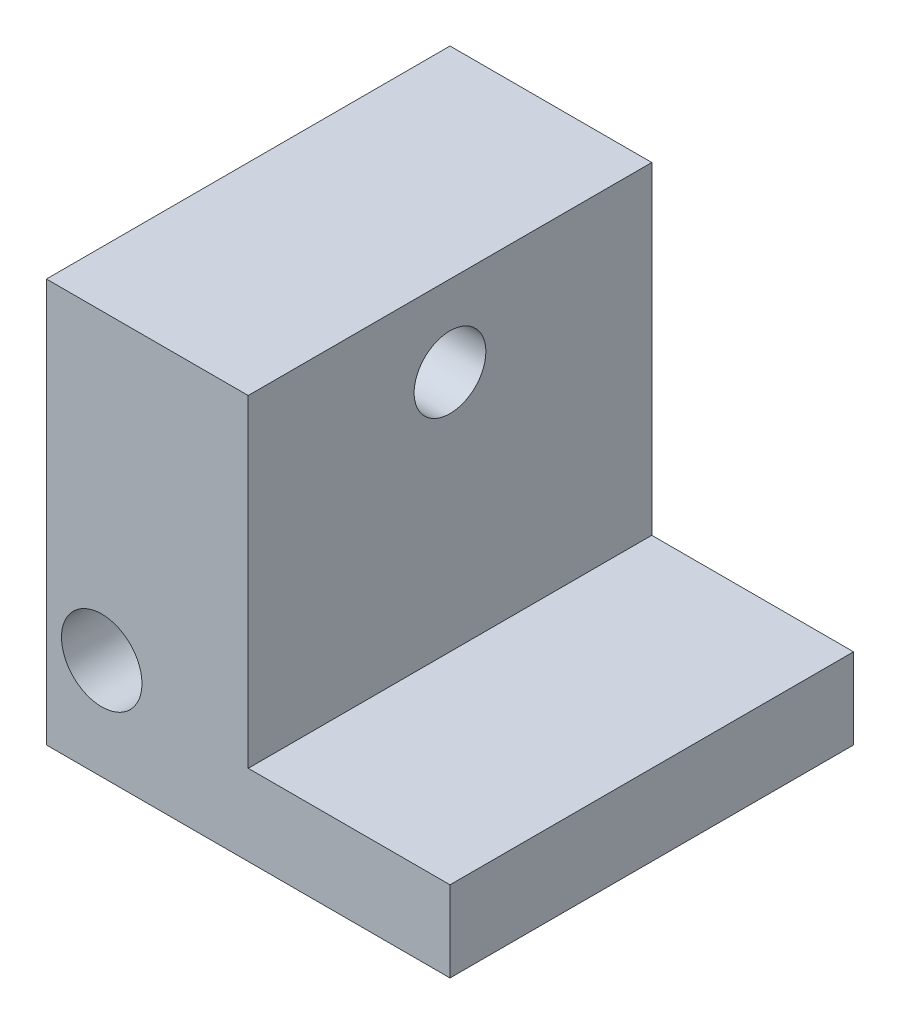
ISO-10303-21;
HEADER;
FILE_DESCRIPTION(('STEP AP214'),'2;1');
FILE_NAME('part.step','',(''),(''),'','','');
FILE_SCHEMA(('AUTOMOTIVE_DESIGN { 1 0 10303 214 1 1 1 1 }'));
ENDSEC;
DATA;
#1=APPLICATION_CONTEXT('core data for automotive mechanical design processes');
#2=APPLICATION_PROTOCOL_DEFINITION('international standard','automotive_design',2000,#1);
#3=PRODUCT_CONTEXT('',#1,'mechanical');
#4=PRODUCT('Part','Part','',(#3));
#5=PRODUCT_RELATED_PRODUCT_CATEGORY('part','',(#4));
#6=PRODUCT_DEFINITION_FORMATION('','',#4);
#7=PRODUCT_DEFINITION_CONTEXT('part definition',#1,'design');
#8=PRODUCT_DEFINITION('design','',#6,#7);
#9=PRODUCT_DEFINITION_SHAPE('','',#8);
#10=(LENGTH_UNIT() NAMED_UNIT(*) SI_UNIT(.MILLI.,.METRE.));
#11=(NAMED_UNIT(*) PLANE_ANGLE_UNIT() SI_UNIT($,.RADIAN.));
#12=(NAMED_UNIT(*) SI_UNIT($,.STERADIAN.) SOLID_ANGLE_UNIT());
#13=UNCERTAINTY_MEASURE_WITH_UNIT(LENGTH_MEASURE(1.E-05),#10,'distance_accuracy_value','');
#14=(GEOMETRIC_REPRESENTATION_CONTEXT(3) GLOBAL_UNCERTAINTY_ASSIGNED_CONTEXT((#13)) GLOBAL_UNIT_ASSIGNED_CONTEXT((#10,
#11,#12)) REPRESENTATION_CONTEXT('',''));
#15=CARTESIAN_POINT('',(0.,0.,0.));
#16=DIRECTION('',(0.,0.,1.));
#17=DIRECTION('',(1.,0.,0.));
#18=AXIS2_PLACEMENT_3D('',#15,#16,#17);
#19=CARTESIAN_POINT('',(0.,0.,10.));
#20=DIRECTION('',(1.,0.,0.));
#21=DIRECTION('',(0.,0.,-1.));
#22=AXIS2_PLACEMENT_3D('',#19,#20,#21);
#23=PLANE('',#22);
#24=CARTESIAN_POINT('',(0.,8.,5.));
#25=DIRECTION('',(1.,0.,0.));
#26=DIRECTION('',(0.,0.,-1.));
#27=AXIS2_PLACEMENT_3D('',#24,#25,#26);
#28=CIRCLE('',#27,0.888999999999999);
#29=CARTESIAN_POINT('',(0.,8.,4.111));
#30=VERTEX_POINT('',#29);
#31=EDGE_CURVE('E43',#30,#30,#28,.T.);
#32=ORIENTED_EDGE('',*,*,#31,.T.);
#33=EDGE_LOOP('',(#32));
#34=FACE_BOUND('',#33,.T.);
#35=CARTESIAN_POINT('',(0.,2.5,5.));
#36=DIRECTION('',(-1.,0.,0.));
#37=DIRECTION('',(0.,0.,1.));
#38=AXIS2_PLACEMENT_3D('',#35,#36,#37);
#39=CIRCLE('',#38,1.25);
#40=CARTESIAN_POINT('',(0.,2.5,6.25));
#41=VERTEX_POINT('',#40);
#42=EDGE_CURVE('E135',#41,#41,#39,.T.);
#43=ORIENTED_EDGE('',*,*,#42,.F.);
#44=EDGE_LOOP('',(#43));
#45=FACE_BOUND('',#44,.T.);
#46=DIRECTION('',(0.,-1.,0.));
#47=VECTOR('',#46,1.);
#48=CARTESIAN_POINT('',(0.,0.,0.));
#49=LINE('',#48,#47);
#50=CARTESIAN_POINT('',(0.,10.,0.));
#51=VERTEX_POINT('',#50);
#52=CARTESIAN_POINT('',(0.,0.,0.));
#53=VERTEX_POINT('',#52);
#54=EDGE_CURVE('E116',#51,#53,#49,.T.);
#55=ORIENTED_EDGE('',*,*,#54,.T.);
#56=DIRECTION('',(0.,0.,-1.));
#57=VECTOR('',#56,1.);
#58=CARTESIAN_POINT('',(0.,0.,10.));
#59=LINE('',#58,#57);
#60=CARTESIAN_POINT('',(0.,0.,10.));
#61=VERTEX_POINT('',#60);
#62=EDGE_CURVE('E11',#61,#53,#59,.T.);
#63=ORIENTED_EDGE('',*,*,#62,.F.);
#64=DIRECTION('',(0.,-1.,0.));
#65=VECTOR('',#64,1.);
#66=CARTESIAN_POINT('',(0.,0.,10.));
#67=LINE('',#66,#65);
#68=CARTESIAN_POINT('',(0.,10.,10.));
#69=VERTEX_POINT('',#68);
#70=EDGE_CURVE('E117',#69,#61,#67,.T.);
#71=ORIENTED_EDGE('',*,*,#70,.F.);
#72=DIRECTION('',(0.,0.,-1.));
#73=VECTOR('',#72,1.);
#74=CARTESIAN_POINT('',(0.,10.,10.));
#75=LINE('',#74,#73);
#76=EDGE_CURVE('E126',#69,#51,#75,.T.);
#77=ORIENTED_EDGE('',*,*,#76,.T.);
#78=EDGE_LOOP('',(#55,#63,#71,#77));
#79=FACE_BOUND('',#78,.T.);
#80=ADVANCED_FACE('F40',(#34,#45,#79),#23,.F.);
#81=CARTESIAN_POINT('',(0.,0.,10.));
#82=DIRECTION('',(0.,1.,0.));
#83=DIRECTION('',(0.,0.,1.));
#84=AXIS2_PLACEMENT_3D('',#81,#82,#83);
#85=PLANE('',#84);
#86=DIRECTION('',(1.,0.,0.));
#87=VECTOR('',#86,1.);
#88=CARTESIAN_POINT('',(0.,0.,0.));
#89=LINE('',#88,#87);
#90=CARTESIAN_POINT('',(10.,0.,0.));
#91=VERTEX_POINT('',#90);
#92=EDGE_CURVE('E122',#53,#91,#89,.T.);
#93=ORIENTED_EDGE('',*,*,#92,.T.);
#94=DIRECTION('',(0.,0.,-1.));
#95=VECTOR('',#94,1.);
#96=CARTESIAN_POINT('',(10.,0.,10.));
#97=LINE('',#96,#95);
#98=CARTESIAN_POINT('',(10.,0.,10.));
#99=VERTEX_POINT('',#98);
#100=EDGE_CURVE('E48',#99,#91,#97,.T.);
#101=ORIENTED_EDGE('',*,*,#100,.F.);
#102=DIRECTION('',(1.,0.,0.));
#103=VECTOR('',#102,1.);
#104=CARTESIAN_POINT('',(0.,0.,10.));
#105=LINE('',#104,#103);
#106=EDGE_CURVE('E88',#61,#99,#105,.T.);
#107=ORIENTED_EDGE('',*,*,#106,.F.);
#108=ORIENTED_EDGE('',*,*,#62,.T.);
#109=EDGE_LOOP('',(#93,#101,#107,#108));
#110=FACE_BOUND('',#109,.T.);
#111=ADVANCED_FACE('F156',(#110),#85,.F.);
#112=CARTESIAN_POINT('',(10.,0.,10.));
#113=DIRECTION('',(-1.,0.,0.));
#114=DIRECTION('',(0.,0.,1.));
#115=AXIS2_PLACEMENT_3D('',#112,#113,#114);
#116=PLANE('',#115);
#117=DIRECTION('',(0.,1.,0.));
#118=VECTOR('',#117,1.);
#119=CARTESIAN_POINT('',(10.,0.,0.));
#120=LINE('',#119,#118);
#121=CARTESIAN_POINT('',(10.,2.,0.));
#122=VERTEX_POINT('',#121);
#123=EDGE_CURVE('E118',#91,#122,#120,.T.);
#124=ORIENTED_EDGE('',*,*,#123,.T.);
#125=DIRECTION('',(0.,0.,1.));
#126=VECTOR('',#125,1.);
#127=CARTESIAN_POINT('',(10.,2.,0.));
#128=LINE('',#127,#126);
#129=CARTESIAN_POINT('',(10.,2.,10.));
#130=VERTEX_POINT('',#129);
#131=EDGE_CURVE('E170',#122,#130,#128,.T.);
#132=ORIENTED_EDGE('',*,*,#131,.T.);
#133=DIRECTION('',(0.,1.,0.));
#134=VECTOR('',#133,1.);
#135=CARTESIAN_POINT('',(10.,0.,10.));
#136=LINE('',#135,#134);
#137=EDGE_CURVE('E176',#99,#130,#136,.T.);
#138=ORIENTED_EDGE('',*,*,#137,.F.);
#139=ORIENTED_EDGE('',*,*,#100,.T.);
#140=EDGE_LOOP('',(#124,#132,#138,#139));
#141=FACE_BOUND('',#140,.T.);
#142=ADVANCED_FACE('F161',(#141),#116,.F.);
#143=CARTESIAN_POINT('',(0.,10.,10.));
#144=DIRECTION('',(0.,-1.,0.));
#145=DIRECTION('',(0.,0.,-1.));
#146=AXIS2_PLACEMENT_3D('',#143,#144,#145);
#147=PLANE('',#146);
#148=DIRECTION('',(-1.,0.,0.));
#149=VECTOR('',#148,1.);
#150=CARTESIAN_POINT('',(0.,10.,10.));
#151=LINE('',#150,#149);
#152=CARTESIAN_POINT('',(5.,10.,10.));
#153=VERTEX_POINT('',#152);
#154=EDGE_CURVE('E65',#153,#69,#151,.T.);
#155=ORIENTED_EDGE('',*,*,#154,.F.);
#156=DIRECTION('',(0.,0.,1.));
#157=VECTOR('',#156,1.);
#158=CARTESIAN_POINT('',(5.,10.,0.));
#159=LINE('',#158,#157);
#160=CARTESIAN_POINT('',(5.,10.,0.));
#161=VERTEX_POINT('',#160);
#162=EDGE_CURVE('E106',#161,#153,#159,.T.);
#163=ORIENTED_EDGE('',*,*,#162,.F.);
#164=DIRECTION('',(-1.,0.,0.));
#165=VECTOR('',#164,1.);
#166=CARTESIAN_POINT('',(0.,10.,0.));
#167=LINE('',#166,#165);
#168=EDGE_CURVE('E83',#161,#51,#167,.T.);
#169=ORIENTED_EDGE('',*,*,#168,.T.);
#170=ORIENTED_EDGE('',*,*,#76,.F.);
#171=EDGE_LOOP('',(#155,#163,#169,#170));
#172=FACE_BOUND('',#171,.T.);
#173=ADVANCED_FACE('F111',(#172),#147,.F.);
#174=CARTESIAN_POINT('',(0.,10.,10.));
#175=DIRECTION('',(0.,0.,-1.));
#176=DIRECTION('',(-1.,0.,0.));
#177=AXIS2_PLACEMENT_3D('',#174,#175,#176);
#178=PLANE('',#177);
#179=CARTESIAN_POINT('',(1.37,2.5,10.));
#180=DIRECTION('',(0.,0.,1.));
#181=DIRECTION('',(1.,0.,0.));
#182=AXIS2_PLACEMENT_3D('',#179,#180,#181);
#183=CIRCLE('',#182,0.996949999999999);
#184=CARTESIAN_POINT('',(2.36695,2.5,10.));
#185=VERTEX_POINT('',#184);
#186=EDGE_CURVE('E136',#185,#185,#183,.T.);
#187=ORIENTED_EDGE('',*,*,#186,.F.);
#188=EDGE_LOOP('',(#187));
#189=FACE_BOUND('',#188,.T.);
#190=ORIENTED_EDGE('',*,*,#137,.T.);
#191=DIRECTION('',(1.,0.,0.));
#192=VECTOR('',#191,1.);
#193=CARTESIAN_POINT('',(10.,2.,10.));
#194=LINE('',#193,#192);
#195=CARTESIAN_POINT('',(5.,2.,10.));
#196=VERTEX_POINT('',#195);
#197=EDGE_CURVE('E109',#196,#130,#194,.T.);
#198=ORIENTED_EDGE('',*,*,#197,.F.);
#199=DIRECTION('',(0.,-1.,0.));
#200=VECTOR('',#199,1.);
#201=CARTESIAN_POINT('',(5.,10.,10.));
#202=LINE('',#201,#200);
#203=EDGE_CURVE('E182',#153,#196,#202,.T.);
#204=ORIENTED_EDGE('',*,*,#203,.F.);
#205=ORIENTED_EDGE('',*,*,#154,.T.);
#206=ORIENTED_EDGE('',*,*,#70,.T.);
#207=ORIENTED_EDGE('',*,*,#106,.T.);
#208=EDGE_LOOP('',(#190,#198,#204,#205,#206,#207));
#209=FACE_BOUND('',#208,.T.);
#210=ADVANCED_FACE('F203',(#189,#209),#178,.F.);
#211=CARTESIAN_POINT('',(0.,10.,0.));
#212=DIRECTION('',(0.,0.,-1.));
#213=DIRECTION('',(-1.,0.,0.));
#214=AXIS2_PLACEMENT_3D('',#211,#212,#213);
#215=PLANE('',#214);
#216=DIRECTION('',(1.,0.,0.));
#217=VECTOR('',#216,1.);
#218=CARTESIAN_POINT('',(10.,2.,0.));
#219=LINE('',#218,#217);
#220=CARTESIAN_POINT('',(5.,2.,0.));
#221=VERTEX_POINT('',#220);
#222=EDGE_CURVE('E56',#221,#122,#219,.T.);
#223=ORIENTED_EDGE('',*,*,#222,.T.);
#224=ORIENTED_EDGE('',*,*,#123,.F.);
#225=ORIENTED_EDGE('',*,*,#92,.F.);
#226=ORIENTED_EDGE('',*,*,#54,.F.);
#227=ORIENTED_EDGE('',*,*,#168,.F.);
#228=DIRECTION('',(0.,-1.,0.));
#229=VECTOR('',#228,1.);
#230=CARTESIAN_POINT('',(5.,10.,0.));
#231=LINE('',#230,#229);
#232=EDGE_CURVE('E103',#161,#221,#231,.T.);
#233=ORIENTED_EDGE('',*,*,#232,.T.);
#234=EDGE_LOOP('',(#223,#224,#225,#226,#227,#233));
#235=FACE_BOUND('',#234,.T.);
#236=ADVANCED_FACE('F114',(#235),#215,.T.);
#237=CARTESIAN_POINT('',(10.,2.,0.));
#238=DIRECTION('',(0.,-1.,0.));
#239=DIRECTION('',(0.,0.,-1.));
#240=AXIS2_PLACEMENT_3D('',#237,#238,#239);
#241=PLANE('',#240);
#242=ORIENTED_EDGE('',*,*,#197,.T.);
#243=ORIENTED_EDGE('',*,*,#131,.F.);
#244=ORIENTED_EDGE('',*,*,#222,.F.);
#245=DIRECTION('',(0.,0.,1.));
#246=VECTOR('',#245,1.);
#247=CARTESIAN_POINT('',(5.,2.,0.));
#248=LINE('',#247,#246);
#249=EDGE_CURVE('E107',#221,#196,#248,.T.);
#250=ORIENTED_EDGE('',*,*,#249,.T.);
#251=EDGE_LOOP('',(#242,#243,#244,#250));
#252=FACE_BOUND('',#251,.T.);
#253=ADVANCED_FACE('F197',(#252),#241,.F.);
#254=CARTESIAN_POINT('',(5.,10.,0.));
#255=DIRECTION('',(-1.,0.,0.));
#256=DIRECTION('',(0.,-1.,0.));
#257=AXIS2_PLACEMENT_3D('',#254,#255,#256);
#258=PLANE('',#257);
#259=CARTESIAN_POINT('',(5.,8.,5.));
#260=DIRECTION('',(1.,0.,0.));
#261=DIRECTION('',(0.,0.,-1.));
#262=AXIS2_PLACEMENT_3D('',#259,#260,#261);
#263=CIRCLE('',#262,0.888999999999999);
#264=CARTESIAN_POINT('',(5.,8.,4.111));
#265=VERTEX_POINT('',#264);
#266=EDGE_CURVE('E190',#265,#265,#263,.T.);
#267=ORIENTED_EDGE('',*,*,#266,.F.);
#268=EDGE_LOOP('',(#267));
#269=FACE_BOUND('',#268,.T.);
#270=ORIENTED_EDGE('',*,*,#203,.T.);
#271=ORIENTED_EDGE('',*,*,#249,.F.);
#272=ORIENTED_EDGE('',*,*,#232,.F.);
#273=ORIENTED_EDGE('',*,*,#162,.T.);
#274=EDGE_LOOP('',(#270,#271,#272,#273));
#275=FACE_BOUND('',#274,.T.);
#276=ADVANCED_FACE('F105',(#269,#275),#258,.F.);
#277=CARTESIAN_POINT('',(4.5,2.5,5.));
#278=DIRECTION('',(-1.,0.,0.));
#279=DIRECTION('',(0.,0.,1.));
#280=AXIS2_PLACEMENT_3D('',#277,#278,#279);
#281=CYLINDRICAL_SURFACE('',#280,1.25);
#282=CARTESIAN_POINT('',(2.36695,2.5,6.25));
#283=CARTESIAN_POINT('',(2.36694594630764,2.54791313103867,6.2499960646669));
#284=CARTESIAN_POINT('',(2.36346836075757,2.59587972387663,6.24721773356943));
#285=CARTESIAN_POINT('',(2.34979324779088,2.69025986717115,6.23635311687289));
#286=CARTESIAN_POINT('',(2.33958394402582,2.73667054595228,6.22825752945655));
#287=CARTESIAN_POINT('',(2.31318001371666,2.82633151815205,6.20752340205111));
#288=CARTESIAN_POINT('',(2.297022423587,2.8695994249651,6.19491298627052));
#289=CARTESIAN_POINT('',(2.25952117219664,2.95247513095169,6.16605999656845));
#290=CARTESIAN_POINT('',(2.23817689470435,2.99208249444279,6.14981699107641));
#291=CARTESIAN_POINT('',(2.18286914021065,3.08027875560777,6.1085555323129));
#292=CARTESIAN_POINT('',(2.14709594981161,3.12722273012476,6.08244678337511));
#293=CARTESIAN_POINT('',(2.06876776926455,3.2134724476195,6.02765664579406));
#294=CARTESIAN_POINT('',(2.02619344852624,3.2527556879721,5.99896802924648));
#295=CARTESIAN_POINT('',(1.93426984107149,3.32398385864142,5.94110741756957));
#296=CARTESIAN_POINT('',(1.88482563389917,3.35580539246783,5.91193483272516));
#297=CARTESIAN_POINT('',(1.77967606508001,3.41081112042258,5.85698183920585));
#298=CARTESIAN_POINT('',(1.72399261398733,3.43402437880897,5.83119020965493));
#299=CARTESIAN_POINT('',(1.63118892262307,3.46278195224579,5.79738467919047));
#300=CARTESIAN_POINT('',(1.59617328135613,3.47164715591319,5.78646474342493));
#301=CARTESIAN_POINT('',(1.52438817329319,3.48559841187969,5.76890974280709));
#302=CARTESIAN_POINT('',(1.48762323642806,3.49069371426182,5.76226419530484));
#303=CARTESIAN_POINT('',(1.41282619487753,3.49674011402863,5.75434611906331));
#304=CARTESIAN_POINT('',(1.37478597597296,3.49765562043814,5.75311973736022));
#305=CARTESIAN_POINT('',(1.29908987207632,3.49514763426627,5.7564282694666));
#306=CARTESIAN_POINT('',(1.26143435628528,3.49172030795598,5.76096827368558));
#307=CARTESIAN_POINT('',(1.18175340228749,3.47997353079027,5.77604970509553));
#308=CARTESIAN_POINT('',(1.13999923589683,3.47095589358572,5.78743895382164));
#309=CARTESIAN_POINT('',(1.05928896434878,3.44822831094768,5.81466340878495));
#310=CARTESIAN_POINT('',(1.02034149347528,3.43450457633048,5.83051165540955));
#311=CARTESIAN_POINT('',(0.927241632400093,3.39527782092615,5.8730192094996));
#312=CARTESIAN_POINT('',(0.874841508493267,3.36728767765739,5.90120098422096));
#313=CARTESIAN_POINT('',(0.776242985823805,3.30301176619865,5.95893336767244));
#314=CARTESIAN_POINT('',(0.730053620305662,3.26671411797453,5.98848588789053));
#315=CARTESIAN_POINT('',(0.643135292758055,3.18499754065215,6.04683595170898));
#316=CARTESIAN_POINT('',(0.602573703772724,3.13937139517527,6.07559557636781));
#317=CARTESIAN_POINT('',(0.529629181817666,3.03987656640665,6.12880328187914));
#318=CARTESIAN_POINT('',(0.497224151951312,2.98603080156488,6.15326295621664));
#319=CARTESIAN_POINT('',(0.450380262457955,2.88763545742939,6.18917522968529));
#320=CARTESIAN_POINT('',(0.433455570721597,2.84489338855595,6.2023441395035));
#321=CARTESIAN_POINT('',(0.405482940532336,2.7564404904196,6.22425792414338));
#322=CARTESIAN_POINT('',(0.394430556923111,2.71073193619151,6.23300614504425));
#323=CARTESIAN_POINT('',(0.378834650698276,2.61727950874941,6.24538214813328));
#324=CARTESIAN_POINT('',(0.374324166681739,2.56952654973358,6.24898393791902));
#325=CARTESIAN_POINT('',(0.372246044843347,2.47377343810017,6.25064105628643));
#326=CARTESIAN_POINT('',(0.374677282484462,2.42577332677795,6.24869728323184));
#327=CARTESIAN_POINT('',(0.385836922686867,2.33488045476381,6.23982167669379));
#328=CARTESIAN_POINT('',(0.394055356122342,2.29188279611388,6.23329390687223));
#329=CARTESIAN_POINT('',(0.415760723501566,2.20808996023358,6.21619027486356));
#330=CARTESIAN_POINT('',(0.429249261440738,2.16729545785687,6.20561318025416));
#331=CARTESIAN_POINT('',(0.461902042878435,2.08611001175119,6.18030463618261));
#332=CARTESIAN_POINT('',(0.481376714818104,2.0459154775707,6.16534890732585));
#333=CARTESIAN_POINT('',(0.524845283717412,1.96937590961565,6.13255208013218));
#334=CARTESIAN_POINT('',(0.548839345022259,1.93303101590635,6.11471087686985));
#335=CARTESIAN_POINT('',(0.605669412990705,1.85786919496066,6.07346928064457));
#336=CARTESIAN_POINT('',(0.639319185361786,1.8198953801605,6.04965678966273));
#337=CARTESIAN_POINT('',(0.711553086751584,1.74973355210724,6.00071845395065));
#338=CARTESIAN_POINT('',(0.750151805061311,1.7175633512338,5.97558886144762));
#339=CARTESIAN_POINT('',(0.840527764970733,1.65307571983167,5.92052409227108));
#340=CARTESIAN_POINT('',(0.893368894403633,1.62215221061245,5.89069059882278));
#341=CARTESIAN_POINT('',(1.0058717028361,1.56987624557944,5.83593587935145));
#342=CARTESIAN_POINT('',(1.0654998247918,1.54847906652465,5.81099201390827));
#343=CARTESIAN_POINT('',(1.16211672123697,1.52434551960706,5.78152601136656));
#344=CARTESIAN_POINT('',(1.19681493728106,1.51755574137305,5.77289499859335));
#345=CARTESIAN_POINT('',(1.26751479193986,1.50769284738491,5.76019236266776));
#346=CARTESIAN_POINT('',(1.30351303669394,1.50461068606657,5.75610964473606));
#347=CARTESIAN_POINT('',(1.37602206464852,1.50240631859917,5.75320105734353));
#348=CARTESIAN_POINT('',(1.41253444415998,1.50330240131547,5.75439946620074));
#349=CARTESIAN_POINT('',(1.48474366278481,1.5090102937327,5.76187859846467));
#350=CARTESIAN_POINT('',(1.52043906711584,1.51382851901872,5.76816764871582));
#351=CARTESIAN_POINT('',(1.60051793429232,1.52897418866395,5.78727018627078));
#352=CARTESIAN_POINT('',(1.64433075722433,1.54051335422685,5.80146720088982));
#353=CARTESIAN_POINT('',(1.72863426887915,1.56872157624533,5.83407780012386));
#354=CARTESIAN_POINT('',(1.76911405306091,1.58540668450743,5.85250453189754));
#355=CARTESIAN_POINT('',(1.8636838898649,1.63164426996262,5.89998778779711));
#356=CARTESIAN_POINT('',(1.91601152566702,1.66363503524519,5.93017569005845));
#357=CARTESIAN_POINT('',(2.01388613395558,1.73643347537613,5.99081864287542));
#358=CARTESIAN_POINT('',(2.05943374898802,1.77724031382113,6.02127366782565));
#359=CARTESIAN_POINT('',(2.13689200871294,1.86083576665303,6.07520558545781));
#360=CARTESIAN_POINT('',(2.16982324140889,1.90243801764699,6.09904826665542));
#361=CARTESIAN_POINT('',(2.22930820370666,1.99170480956034,6.14306679283569));
#362=CARTESIAN_POINT('',(2.25587123484784,2.03936035121022,6.1632479752694));
#363=CARTESIAN_POINT('',(2.29720521832799,2.13088631617462,6.19505678549844));
#364=CARTESIAN_POINT('',(2.31324113330425,2.17387544928014,6.20757192496208));
#365=CARTESIAN_POINT('',(2.33937252311626,2.26261212210069,6.22809098147718));
#366=CARTESIAN_POINT('',(2.34948071891494,2.30835352092249,6.23610455737461));
#367=CARTESIAN_POINT('',(2.35984683020468,2.37875578720889,6.2443406306598));
#368=CARTESIAN_POINT('',(2.36250444727063,2.40287220121629,6.24645681345069));
#369=CARTESIAN_POINT('',(2.36605724911722,2.45132111233798,6.24928764669822));
#370=CARTESIAN_POINT('',(2.36695205982356,2.47565365421527,6.25000199968105));
#371=CARTESIAN_POINT('',(2.36695,2.5,6.25));
#372=B_SPLINE_CURVE_WITH_KNOTS('',3,(#282,#283,#284,#285,#286,#287,#288,#289,#290,#291,#292,
#293,#294,#295,#296,#297,#298,#299,#300,#301,#302,#303,#304,#305,#306,#307,#308,#309,#310,#311,
#312,#313,#314,#315,#316,#317,#318,#319,#320,#321,#322,#323,#324,#325,#326,#327,#328,#329,#330,
#331,#332,#333,#334,#335,#336,#337,#338,#339,#340,#341,#342,#343,#344,#345,#346,#347,#348,#349,
#350,#351,#352,#353,#354,#355,#356,#357,#358,#359,#360,#361,#362,#363,#364,#365,#366,#367,#368,
#369,#370,#371),.UNSPECIFIED.,.T.,.F.,(4,2,2,2,2,2,2,2,2,2,2,2,2,2,2,2,2,2,2,2,2,2,2,2,2,2,2,2,
2,2,2,2,2,2,2,2,2,2,2,2,2,2,2,2,4),(0.,0.143634603638508,0.287521148137266,0.430526545227813,
0.573548941138537,0.76614157206108,0.959291673583605,1.15544045208612,1.3509208069288,
1.46375782685091,1.57631705567501,1.68983296071411,1.80344914420657,1.93533936288091,
2.06761937842303,2.26385093133359,2.46036487553391,2.66184203867483,2.86276735951872,
3.00565421576678,3.14843275641133,3.29192989137425,3.43540378157256,3.56760079854536,
3.69983808204346,3.84062017007082,3.98140737855321,4.14895344375565,4.31700530093995,
4.52042509244238,4.72287955099608,4.83165881084082,4.94017213746903,5.04918483906357,
5.15837621570001,5.30001781352059,5.44210578256399,5.64615359667229,5.85018206073762,
6.02402552245465,6.19761349598189,6.33971570497044,6.48151183410297,6.55448214132781,
6.62746793146567),.UNSPECIFIED.);
#373=CARTESIAN_POINT('',(2.36695,2.5,6.25));
#374=VERTEX_POINT('',#373);
#375=EDGE_CURVE('E129',#374,#374,#372,.T.);
#376=ORIENTED_EDGE('',*,*,#375,.T.);
#377=EDGE_LOOP('',(#376));
#378=FACE_BOUND('',#377,.T.);
#379=CARTESIAN_POINT('',(4.5,2.5,5.));
#380=DIRECTION('',(-1.,0.,0.));
#381=DIRECTION('',(0.,0.,1.));
#382=AXIS2_PLACEMENT_3D('',#379,#380,#381);
#383=CIRCLE('',#382,1.25);
#384=CARTESIAN_POINT('',(4.5,2.5,6.25));
#385=VERTEX_POINT('',#384);
#386=EDGE_CURVE('E184',#385,#385,#383,.T.);
#387=ORIENTED_EDGE('',*,*,#386,.F.);
#388=EDGE_LOOP('',(#387));
#389=FACE_BOUND('',#388,.T.);
#390=ORIENTED_EDGE('',*,*,#42,.T.);
#391=EDGE_LOOP('',(#390));
#392=FACE_BOUND('',#391,.T.);
#393=ADVANCED_FACE('F137',(#378,#389,#392),#281,.F.);
#394=CARTESIAN_POINT('',(4.5,2.5,5.));
#395=DIRECTION('',(-1.,0.,0.));
#396=DIRECTION('',(0.,0.,1.));
#397=AXIS2_PLACEMENT_3D('',#394,#395,#396);
#398=PLANE('',#397);
#399=ORIENTED_EDGE('',*,*,#386,.T.);
#400=EDGE_LOOP('',(#399));
#401=FACE_BOUND('',#400,.T.);
#402=ADVANCED_FACE('F146',(#401),#398,.T.);
#403=CARTESIAN_POINT('',(1.37,2.5,10.));
#404=DIRECTION('',(0.,0.,1.));
#405=DIRECTION('',(1.,0.,0.));
#406=AXIS2_PLACEMENT_3D('',#403,#404,#405);
#407=CYLINDRICAL_SURFACE('',#406,0.996949999999999);
#408=ORIENTED_EDGE('',*,*,#186,.T.);
#409=EDGE_LOOP('',(#408));
#410=FACE_BOUND('',#409,.T.);
#411=ORIENTED_EDGE('',*,*,#375,.F.);
#412=EDGE_LOOP('',(#411));
#413=FACE_BOUND('',#412,.T.);
#414=ADVANCED_FACE('F141',(#410,#413),#407,.F.);
#415=CARTESIAN_POINT('',(5.,8.,5.));
#416=DIRECTION('',(1.,0.,0.));
#417=DIRECTION('',(0.,0.,-1.));
#418=AXIS2_PLACEMENT_3D('',#415,#416,#417);
#419=CYLINDRICAL_SURFACE('',#418,0.888999999999999);
#420=ORIENTED_EDGE('',*,*,#266,.T.);
#421=EDGE_LOOP('',(#420));
#422=FACE_BOUND('',#421,.T.);
#423=ORIENTED_EDGE('',*,*,#31,.F.);
#424=EDGE_LOOP('',(#423));
#425=FACE_BOUND('',#424,.T.);
#426=ADVANCED_FACE('F145',(#422,#425),#419,.F.);
#427=CLOSED_SHELL('',(#80,#111,#142,#173,#210,#236,#253,#276,#393,#402,#414,#426));
#428=MANIFOLD_SOLID_BREP('B2',#427);
#429=ADVANCED_BREP_SHAPE_REPRESENTATION('',(#18,#428),#14);
#430=SHAPE_DEFINITION_REPRESENTATION(#9,#429);
ENDSEC;
END-ISO-10303-21;
